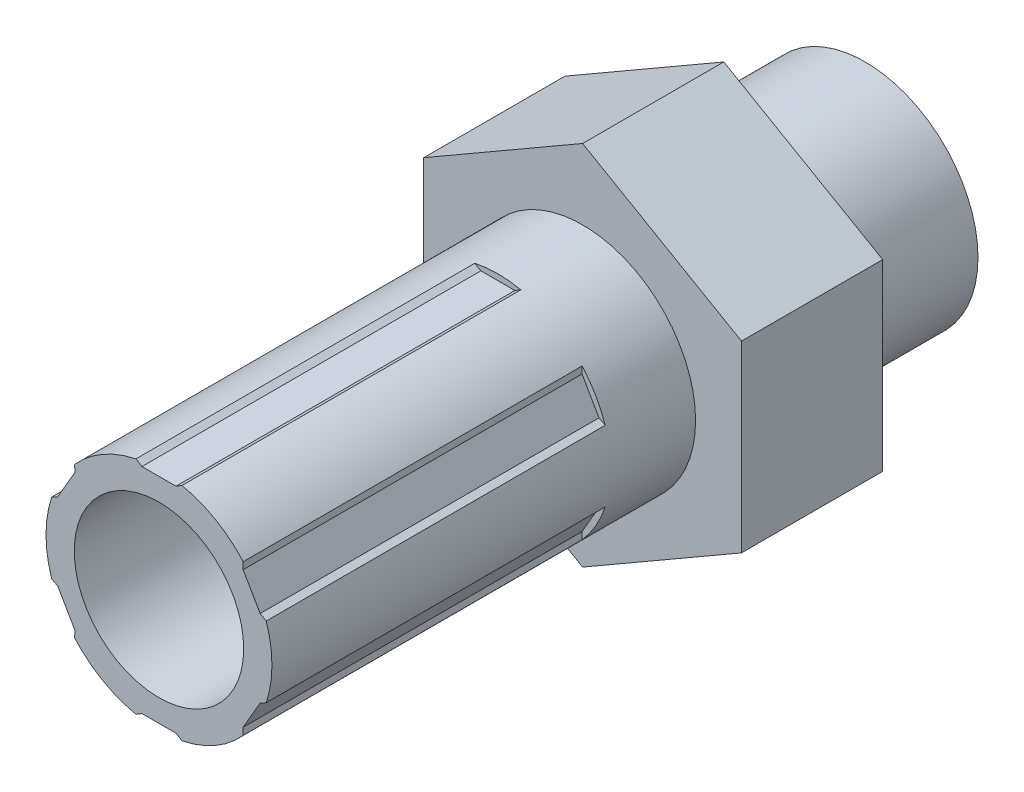
ISO-10303-21;
HEADER;
FILE_DESCRIPTION(('STEP AP214'),'2;1');
FILE_NAME('part.step','',(''),(''),'','','');
FILE_SCHEMA(('AUTOMOTIVE_DESIGN { 1 0 10303 214 1 1 1 1 }'));
ENDSEC;
DATA;
#1=APPLICATION_CONTEXT('core data for automotive mechanical design processes');
#2=APPLICATION_PROTOCOL_DEFINITION('international standard','automotive_design',2000,#1);
#3=PRODUCT_CONTEXT('',#1,'mechanical');
#4=PRODUCT('Part','Part','',(#3));
#5=PRODUCT_RELATED_PRODUCT_CATEGORY('part','',(#4));
#6=PRODUCT_DEFINITION_FORMATION('','',#4);
#7=PRODUCT_DEFINITION_CONTEXT('part definition',#1,'design');
#8=PRODUCT_DEFINITION('design','',#6,#7);
#9=PRODUCT_DEFINITION_SHAPE('','',#8);
#10=(LENGTH_UNIT() NAMED_UNIT(*) SI_UNIT(.MILLI.,.METRE.));
#11=(NAMED_UNIT(*) PLANE_ANGLE_UNIT() SI_UNIT($,.RADIAN.));
#12=(NAMED_UNIT(*) SI_UNIT($,.STERADIAN.) SOLID_ANGLE_UNIT());
#13=UNCERTAINTY_MEASURE_WITH_UNIT(LENGTH_MEASURE(1.E-05),#10,'distance_accuracy_value','');
#14=(GEOMETRIC_REPRESENTATION_CONTEXT(3) GLOBAL_UNCERTAINTY_ASSIGNED_CONTEXT((#13)) GLOBAL_UNIT_ASSIGNED_CONTEXT((#10,
#11,#12)) REPRESENTATION_CONTEXT('',''));
#15=CARTESIAN_POINT('',(0.,0.,0.));
#16=DIRECTION('',(0.,0.,1.));
#17=DIRECTION('',(1.,0.,0.));
#18=AXIS2_PLACEMENT_3D('',#15,#16,#17);
#19=CARTESIAN_POINT('',(0.,8.24889197104678,6.35));
#20=DIRECTION('',(0.,0.,1.));
#21=DIRECTION('',(1.,0.,0.));
#22=AXIS2_PLACEMENT_3D('',#19,#20,#21);
#23=PLANE('',#22);
#24=DIRECTION('',(-0.866025403784439,0.5,0.));
#25=VECTOR('',#24,1.);
#26=CARTESIAN_POINT('',(7.14375,4.12444598552339,6.35));
#27=LINE('',#26,#25);
#28=CARTESIAN_POINT('',(7.14375,4.12444598552339,6.35));
#29=VERTEX_POINT('',#28);
#30=CARTESIAN_POINT('',(0.,8.24889197104678,6.35));
#31=VERTEX_POINT('',#30);
#32=EDGE_CURVE('E388',#29,#31,#27,.T.);
#33=ORIENTED_EDGE('',*,*,#32,.T.);
#34=DIRECTION('',(-0.866025403784438,-0.5,0.));
#35=VECTOR('',#34,1.);
#36=CARTESIAN_POINT('',(0.,8.24889197104678,6.35));
#37=LINE('',#36,#35);
#38=CARTESIAN_POINT('',(-7.14375,4.12444598552338,6.35));
#39=VERTEX_POINT('',#38);
#40=EDGE_CURVE('E391',#31,#39,#37,.T.);
#41=ORIENTED_EDGE('',*,*,#40,.T.);
#42=DIRECTION('',(0.,-1.,0.));
#43=VECTOR('',#42,1.);
#44=CARTESIAN_POINT('',(-7.14375,4.12444598552338,6.35));
#45=LINE('',#44,#43);
#46=CARTESIAN_POINT('',(-7.14375,-4.12444598552339,6.35));
#47=VERTEX_POINT('',#46);
#48=EDGE_CURVE('E394',#39,#47,#45,.T.);
#49=ORIENTED_EDGE('',*,*,#48,.T.);
#50=DIRECTION('',(0.866025403784439,-0.5,0.));
#51=VECTOR('',#50,1.);
#52=CARTESIAN_POINT('',(-7.14375,-4.12444598552339,6.35));
#53=LINE('',#52,#51);
#54=CARTESIAN_POINT('',(0.,-8.24889197104678,6.35));
#55=VERTEX_POINT('',#54);
#56=EDGE_CURVE('E396',#47,#55,#53,.T.);
#57=ORIENTED_EDGE('',*,*,#56,.T.);
#58=DIRECTION('',(0.866025403784439,0.5,0.));
#59=VECTOR('',#58,1.);
#60=CARTESIAN_POINT('',(0.,-8.24889197104678,6.35));
#61=LINE('',#60,#59);
#62=CARTESIAN_POINT('',(7.14375,-4.12444598552339,6.35));
#63=VERTEX_POINT('',#62);
#64=EDGE_CURVE('E398',#55,#63,#61,.T.);
#65=ORIENTED_EDGE('',*,*,#64,.T.);
#66=DIRECTION('',(0.,1.,0.));
#67=VECTOR('',#66,1.);
#68=CARTESIAN_POINT('',(7.14375,-4.12444598552339,6.35));
#69=LINE('',#68,#67);
#70=EDGE_CURVE('E400',#63,#29,#69,.T.);
#71=ORIENTED_EDGE('',*,*,#70,.T.);
#72=EDGE_LOOP('',(#33,#41,#49,#57,#65,#71));
#73=FACE_BOUND('',#72,.T.);
#74=CARTESIAN_POINT('',(0.,0.,6.35));
#75=DIRECTION('',(0.,0.,1.));
#76=DIRECTION('',(1.,0.,0.));
#77=AXIS2_PLACEMENT_3D('',#74,#75,#76);
#78=CIRCLE('',#77,5.08);
#79=CARTESIAN_POINT('',(5.08,0.,6.35));
#80=VERTEX_POINT('',#79);
#81=EDGE_CURVE('E374',#80,#80,#78,.T.);
#82=ORIENTED_EDGE('',*,*,#81,.F.);
#83=EDGE_LOOP('',(#82));
#84=FACE_BOUND('',#83,.T.);
#85=ADVANCED_FACE('F32',(#73,#84),#23,.T.);
#86=CARTESIAN_POINT('',(0.,8.24889197104678,0.));
#87=DIRECTION('',(0.,0.,1.));
#88=DIRECTION('',(1.,0.,0.));
#89=AXIS2_PLACEMENT_3D('',#86,#87,#88);
#90=PLANE('',#89);
#91=DIRECTION('',(-0.866025403784439,0.5,0.));
#92=VECTOR('',#91,1.);
#93=CARTESIAN_POINT('',(7.14375,4.12444598552339,0.));
#94=LINE('',#93,#92);
#95=CARTESIAN_POINT('',(7.14375,4.12444598552339,0.));
#96=VERTEX_POINT('',#95);
#97=CARTESIAN_POINT('',(0.,8.24889197104678,0.));
#98=VERTEX_POINT('',#97);
#99=EDGE_CURVE('E387',#96,#98,#94,.T.);
#100=ORIENTED_EDGE('',*,*,#99,.F.);
#101=DIRECTION('',(0.,1.,0.));
#102=VECTOR('',#101,1.);
#103=CARTESIAN_POINT('',(7.14375,-4.12444598552339,0.));
#104=LINE('',#103,#102);
#105=CARTESIAN_POINT('',(7.14375,-4.12444598552339,0.));
#106=VERTEX_POINT('',#105);
#107=EDGE_CURVE('E392',#106,#96,#104,.T.);
#108=ORIENTED_EDGE('',*,*,#107,.F.);
#109=DIRECTION('',(0.866025403784439,0.5,0.));
#110=VECTOR('',#109,1.);
#111=CARTESIAN_POINT('',(0.,-8.24889197104678,0.));
#112=LINE('',#111,#110);
#113=CARTESIAN_POINT('',(0.,-8.24889197104678,0.));
#114=VERTEX_POINT('',#113);
#115=EDGE_CURVE('E411',#114,#106,#112,.T.);
#116=ORIENTED_EDGE('',*,*,#115,.F.);
#117=DIRECTION('',(0.866025403784439,-0.5,0.));
#118=VECTOR('',#117,1.);
#119=CARTESIAN_POINT('',(-7.14375,-4.12444598552339,0.));
#120=LINE('',#119,#118);
#121=CARTESIAN_POINT('',(-7.14375,-4.12444598552339,0.));
#122=VERTEX_POINT('',#121);
#123=EDGE_CURVE('E409',#122,#114,#120,.T.);
#124=ORIENTED_EDGE('',*,*,#123,.F.);
#125=DIRECTION('',(0.,-1.,0.));
#126=VECTOR('',#125,1.);
#127=CARTESIAN_POINT('',(-7.14375,4.12444598552338,0.));
#128=LINE('',#127,#126);
#129=CARTESIAN_POINT('',(-7.14375,4.12444598552338,0.));
#130=VERTEX_POINT('',#129);
#131=EDGE_CURVE('E407',#130,#122,#128,.T.);
#132=ORIENTED_EDGE('',*,*,#131,.F.);
#133=DIRECTION('',(-0.866025403784438,-0.5,0.));
#134=VECTOR('',#133,1.);
#135=CARTESIAN_POINT('',(0.,8.24889197104678,0.));
#136=LINE('',#135,#134);
#137=EDGE_CURVE('E405',#98,#130,#136,.T.);
#138=ORIENTED_EDGE('',*,*,#137,.F.);
#139=EDGE_LOOP('',(#100,#108,#116,#124,#132,#138));
#140=FACE_BOUND('',#139,.T.);
#141=CARTESIAN_POINT('',(0.,0.,0.));
#142=DIRECTION('',(0.,0.,1.));
#143=DIRECTION('',(1.,0.,0.));
#144=AXIS2_PLACEMENT_3D('',#141,#142,#143);
#145=CIRCLE('',#144,5.08);
#146=CARTESIAN_POINT('',(5.08,0.,0.));
#147=VERTEX_POINT('',#146);
#148=EDGE_CURVE('E431',#147,#147,#145,.F.);
#149=ORIENTED_EDGE('',*,*,#148,.F.);
#150=EDGE_LOOP('',(#149));
#151=FACE_BOUND('',#150,.T.);
#152=ADVANCED_FACE('F538',(#140,#151),#90,.F.);
#153=CARTESIAN_POINT('',(7.14375,4.12444598552339,6.35));
#154=DIRECTION('',(-0.5,-0.866025403784439,0.));
#155=DIRECTION('',(0.866025403784439,-0.5,0.));
#156=AXIS2_PLACEMENT_3D('',#153,#154,#155);
#157=PLANE('',#156);
#158=ORIENTED_EDGE('',*,*,#99,.T.);
#159=DIRECTION('',(0.,0.,-1.));
#160=VECTOR('',#159,1.);
#161=CARTESIAN_POINT('',(0.,8.24889197104678,6.35));
#162=LINE('',#161,#160);
#163=EDGE_CURVE('E428',#31,#98,#162,.T.);
#164=ORIENTED_EDGE('',*,*,#163,.F.);
#165=ORIENTED_EDGE('',*,*,#32,.F.);
#166=DIRECTION('',(0.,0.,-1.));
#167=VECTOR('',#166,1.);
#168=CARTESIAN_POINT('',(7.14375,4.12444598552339,6.35));
#169=LINE('',#168,#167);
#170=EDGE_CURVE('E402',#29,#96,#169,.T.);
#171=ORIENTED_EDGE('',*,*,#170,.T.);
#172=EDGE_LOOP('',(#158,#164,#165,#171));
#173=FACE_BOUND('',#172,.T.);
#174=ADVANCED_FACE('F34',(#173),#157,.F.);
#175=CARTESIAN_POINT('',(0.,8.24889197104678,6.35));
#176=DIRECTION('',(0.5,-0.866025403784438,0.));
#177=DIRECTION('',(0.866025403784438,0.500000000000001,0.));
#178=AXIS2_PLACEMENT_3D('',#175,#176,#177);
#179=PLANE('',#178);
#180=ORIENTED_EDGE('',*,*,#137,.T.);
#181=DIRECTION('',(0.,0.,-1.));
#182=VECTOR('',#181,1.);
#183=CARTESIAN_POINT('',(-7.14375,4.12444598552338,6.35));
#184=LINE('',#183,#182);
#185=EDGE_CURVE('E425',#39,#130,#184,.T.);
#186=ORIENTED_EDGE('',*,*,#185,.F.);
#187=ORIENTED_EDGE('',*,*,#40,.F.);
#188=ORIENTED_EDGE('',*,*,#163,.T.);
#189=EDGE_LOOP('',(#180,#186,#187,#188));
#190=FACE_BOUND('',#189,.T.);
#191=ADVANCED_FACE('F565',(#190),#179,.F.);
#192=CARTESIAN_POINT('',(-7.14375,4.12444598552338,6.35));
#193=DIRECTION('',(1.,0.,0.));
#194=DIRECTION('',(0.,0.,-1.));
#195=AXIS2_PLACEMENT_3D('',#192,#193,#194);
#196=PLANE('',#195);
#197=ORIENTED_EDGE('',*,*,#131,.T.);
#198=DIRECTION('',(0.,0.,-1.));
#199=VECTOR('',#198,1.);
#200=CARTESIAN_POINT('',(-7.14375,-4.12444598552339,6.35));
#201=LINE('',#200,#199);
#202=EDGE_CURVE('E422',#47,#122,#201,.T.);
#203=ORIENTED_EDGE('',*,*,#202,.F.);
#204=ORIENTED_EDGE('',*,*,#48,.F.);
#205=ORIENTED_EDGE('',*,*,#185,.T.);
#206=EDGE_LOOP('',(#197,#203,#204,#205));
#207=FACE_BOUND('',#206,.T.);
#208=ADVANCED_FACE('F562',(#207),#196,.F.);
#209=CARTESIAN_POINT('',(-7.14375,-4.12444598552339,6.35));
#210=DIRECTION('',(0.5,0.866025403784439,0.));
#211=DIRECTION('',(-0.866025403784439,0.5,0.));
#212=AXIS2_PLACEMENT_3D('',#209,#210,#211);
#213=PLANE('',#212);
#214=ORIENTED_EDGE('',*,*,#123,.T.);
#215=DIRECTION('',(0.,0.,-1.));
#216=VECTOR('',#215,1.);
#217=CARTESIAN_POINT('',(0.,-8.24889197104678,6.35));
#218=LINE('',#217,#216);
#219=EDGE_CURVE('E419',#55,#114,#218,.T.);
#220=ORIENTED_EDGE('',*,*,#219,.F.);
#221=ORIENTED_EDGE('',*,*,#56,.F.);
#222=ORIENTED_EDGE('',*,*,#202,.T.);
#223=EDGE_LOOP('',(#214,#220,#221,#222));
#224=FACE_BOUND('',#223,.T.);
#225=ADVANCED_FACE('F558',(#224),#213,.F.);
#226=CARTESIAN_POINT('',(0.,-8.24889197104678,6.35));
#227=DIRECTION('',(-0.5,0.866025403784439,0.));
#228=DIRECTION('',(-0.866025403784439,-0.5,0.));
#229=AXIS2_PLACEMENT_3D('',#226,#227,#228);
#230=PLANE('',#229);
#231=ORIENTED_EDGE('',*,*,#115,.T.);
#232=DIRECTION('',(0.,0.,-1.));
#233=VECTOR('',#232,1.);
#234=CARTESIAN_POINT('',(7.14375,-4.12444598552339,6.35));
#235=LINE('',#234,#233);
#236=EDGE_CURVE('E416',#63,#106,#235,.T.);
#237=ORIENTED_EDGE('',*,*,#236,.F.);
#238=ORIENTED_EDGE('',*,*,#64,.F.);
#239=ORIENTED_EDGE('',*,*,#219,.T.);
#240=EDGE_LOOP('',(#231,#237,#238,#239));
#241=FACE_BOUND('',#240,.T.);
#242=ADVANCED_FACE('F554',(#241),#230,.F.);
#243=CARTESIAN_POINT('',(7.14375,-4.12444598552339,6.35));
#244=DIRECTION('',(-1.,0.,0.));
#245=DIRECTION('',(0.,-1.,0.));
#246=AXIS2_PLACEMENT_3D('',#243,#244,#245);
#247=PLANE('',#246);
#248=ORIENTED_EDGE('',*,*,#107,.T.);
#249=ORIENTED_EDGE('',*,*,#170,.F.);
#250=ORIENTED_EDGE('',*,*,#70,.F.);
#251=ORIENTED_EDGE('',*,*,#236,.T.);
#252=EDGE_LOOP('',(#248,#249,#250,#251));
#253=FACE_BOUND('',#252,.T.);
#254=ADVANCED_FACE('F551',(#253),#247,.F.);
#255=CARTESIAN_POINT('',(0.,0.,-6.35));
#256=DIRECTION('',(0.,0.,1.));
#257=DIRECTION('',(1.,0.,0.));
#258=AXIS2_PLACEMENT_3D('',#255,#256,#257);
#259=CYLINDRICAL_SURFACE('',#258,5.08);
#260=CARTESIAN_POINT('',(0.,0.,-6.35));
#261=DIRECTION('',(0.,0.,-1.));
#262=DIRECTION('',(-1.,0.,0.));
#263=AXIS2_PLACEMENT_3D('',#260,#261,#262);
#264=CIRCLE('',#263,5.08);
#265=CARTESIAN_POINT('',(-5.08,0.,-6.35));
#266=VERTEX_POINT('',#265);
#267=EDGE_CURVE('E380',#266,#266,#264,.T.);
#268=ORIENTED_EDGE('',*,*,#267,.F.);
#269=EDGE_LOOP('',(#268));
#270=FACE_BOUND('',#269,.T.);
#271=ORIENTED_EDGE('',*,*,#148,.T.);
#272=EDGE_LOOP('',(#271));
#273=FACE_BOUND('',#272,.T.);
#274=ADVANCED_FACE('F548',(#270,#273),#259,.T.);
#275=CARTESIAN_POINT('',(0.,0.,-6.35));
#276=DIRECTION('',(0.,0.,-1.));
#277=DIRECTION('',(-1.,0.,0.));
#278=AXIS2_PLACEMENT_3D('',#275,#276,#277);
#279=PLANE('',#278);
#280=CARTESIAN_POINT('',(0.,0.,-6.35));
#281=DIRECTION('',(0.,0.,1.));
#282=DIRECTION('',(1.,0.,0.));
#283=AXIS2_PLACEMENT_3D('',#280,#281,#282);
#284=CIRCLE('',#283,3.81);
#285=CARTESIAN_POINT('',(3.81,0.,-6.35));
#286=VERTEX_POINT('',#285);
#287=EDGE_CURVE('E371',#286,#286,#284,.T.);
#288=ORIENTED_EDGE('',*,*,#287,.T.);
#289=EDGE_LOOP('',(#288));
#290=FACE_BOUND('',#289,.T.);
#291=ORIENTED_EDGE('',*,*,#267,.T.);
#292=EDGE_LOOP('',(#291));
#293=FACE_BOUND('',#292,.T.);
#294=ADVANCED_FACE('F593',(#290,#293),#279,.T.);
#295=CARTESIAN_POINT('',(0.,0.,25.4));
#296=DIRECTION('',(0.,0.,-1.));
#297=DIRECTION('',(-1.,0.,0.));
#298=AXIS2_PLACEMENT_3D('',#295,#296,#297);
#299=CYLINDRICAL_SURFACE('',#298,5.08);
#300=CARTESIAN_POINT('',(0.,0.,25.4));
#301=DIRECTION('',(0.,0.,1.));
#302=DIRECTION('',(1.,0.,0.));
#303=AXIS2_PLACEMENT_3D('',#300,#301,#302);
#304=CIRCLE('',#303,5.08);
#305=CARTESIAN_POINT('',(3.78960210015848,3.38309265650151,25.4));
#306=VERTEX_POINT('',#305);
#307=CARTESIAN_POINT('',(1.03504313380759,4.97343801722287,25.4));
#308=VERTEX_POINT('',#307);
#309=EDGE_CURVE('E382',#306,#308,#304,.T.);
#310=ORIENTED_EDGE('',*,*,#309,.F.);
#311=DIRECTION('',(0.,0.,-1.));
#312=VECTOR('',#311,1.);
#313=CARTESIAN_POINT('',(3.78960210015848,3.38309265650151,25.4));
#314=LINE('',#313,#312);
#315=CARTESIAN_POINT('',(3.78960210015848,3.38309265650151,10.16));
#316=VERTEX_POINT('',#315);
#317=EDGE_CURVE('E258',#306,#316,#314,.T.);
#318=ORIENTED_EDGE('',*,*,#317,.T.);
#319=CARTESIAN_POINT('',(0.,0.,10.16));
#320=DIRECTION('',(0.,0.,-1.));
#321=DIRECTION('',(-1.,0.,0.));
#322=AXIS2_PLACEMENT_3D('',#319,#320,#321);
#323=CIRCLE('',#322,5.08);
#324=CARTESIAN_POINT('',(4.82464523396609,1.59034536072146,10.16));
#325=VERTEX_POINT('',#324);
#326=EDGE_CURVE('E11',#316,#325,#323,.T.);
#327=ORIENTED_EDGE('',*,*,#326,.T.);
#328=DIRECTION('',(0.,0.,-1.));
#329=VECTOR('',#328,1.);
#330=CARTESIAN_POINT('',(4.82464523396609,1.59034536072146,25.4));
#331=LINE('',#330,#329);
#332=CARTESIAN_POINT('',(4.82464523396609,1.59034536072146,25.4));
#333=VERTEX_POINT('',#332);
#334=EDGE_CURVE('E250',#325,#333,#331,.F.);
#335=ORIENTED_EDGE('',*,*,#334,.T.);
#336=CARTESIAN_POINT('',(4.82464523396613,-1.59034536072136,25.4));
#337=VERTEX_POINT('',#336);
#338=EDGE_CURVE('E472',#337,#333,#304,.T.);
#339=ORIENTED_EDGE('',*,*,#338,.F.);
#340=DIRECTION('',(0.,0.,-1.));
#341=VECTOR('',#340,1.);
#342=CARTESIAN_POINT('',(4.82464523396613,-1.59034536072136,25.4));
#343=LINE('',#342,#341);
#344=CARTESIAN_POINT('',(4.82464523396613,-1.59034536072136,10.16));
#345=VERTEX_POINT('',#344);
#346=EDGE_CURVE('E278',#337,#345,#343,.T.);
#347=ORIENTED_EDGE('',*,*,#346,.T.);
#348=CARTESIAN_POINT('',(0.,0.,10.16));
#349=DIRECTION('',(0.,0.,-1.));
#350=DIRECTION('',(-1.,0.,0.));
#351=AXIS2_PLACEMENT_3D('',#348,#349,#350);
#352=CIRCLE('',#351,5.08);
#353=CARTESIAN_POINT('',(3.78960210015855,-3.38309265650143,10.16));
#354=VERTEX_POINT('',#353);
#355=EDGE_CURVE('E460',#345,#354,#352,.T.);
#356=ORIENTED_EDGE('',*,*,#355,.T.);
#357=DIRECTION('',(0.,0.,-1.));
#358=VECTOR('',#357,1.);
#359=CARTESIAN_POINT('',(3.78960210015855,-3.38309265650143,25.4));
#360=LINE('',#359,#358);
#361=CARTESIAN_POINT('',(3.78960210015855,-3.38309265650143,25.4));
#362=VERTEX_POINT('',#361);
#363=EDGE_CURVE('E274',#354,#362,#360,.F.);
#364=ORIENTED_EDGE('',*,*,#363,.T.);
#365=CARTESIAN_POINT('',(1.0350431338076,-4.97343801722287,25.4));
#366=VERTEX_POINT('',#365);
#367=EDGE_CURVE('E477',#366,#362,#304,.T.);
#368=ORIENTED_EDGE('',*,*,#367,.F.);
#369=DIRECTION('',(0.,0.,-1.));
#370=VECTOR('',#369,1.);
#371=CARTESIAN_POINT('',(1.0350431338076,-4.97343801722287,25.4));
#372=LINE('',#371,#370);
#373=CARTESIAN_POINT('',(1.0350431338076,-4.97343801722287,10.16));
#374=VERTEX_POINT('',#373);
#375=EDGE_CURVE('E300',#366,#374,#372,.T.);
#376=ORIENTED_EDGE('',*,*,#375,.T.);
#377=CARTESIAN_POINT('',(0.,0.,10.16));
#378=DIRECTION('',(0.,0.,-1.));
#379=DIRECTION('',(-1.,0.,0.));
#380=AXIS2_PLACEMENT_3D('',#377,#378,#379);
#381=CIRCLE('',#380,5.08);
#382=CARTESIAN_POINT('',(-1.03504313380759,-4.97343801722287,10.16));
#383=VERTEX_POINT('',#382);
#384=EDGE_CURVE('E455',#374,#383,#381,.T.);
#385=ORIENTED_EDGE('',*,*,#384,.T.);
#386=DIRECTION('',(0.,0.,-1.));
#387=VECTOR('',#386,1.);
#388=CARTESIAN_POINT('',(-1.03504313380759,-4.97343801722287,25.4));
#389=LINE('',#388,#387);
#390=CARTESIAN_POINT('',(-1.03504313380759,-4.97343801722287,25.4));
#391=VERTEX_POINT('',#390);
#392=EDGE_CURVE('E296',#383,#391,#389,.F.);
#393=ORIENTED_EDGE('',*,*,#392,.T.);
#394=CARTESIAN_POINT('',(-3.7896021001585,-3.38309265650149,25.4));
#395=VERTEX_POINT('',#394);
#396=EDGE_CURVE('E479',#395,#391,#304,.T.);
#397=ORIENTED_EDGE('',*,*,#396,.F.);
#398=DIRECTION('',(0.,0.,-1.));
#399=VECTOR('',#398,1.);
#400=CARTESIAN_POINT('',(-3.7896021001585,-3.38309265650148,25.4));
#401=LINE('',#400,#399);
#402=CARTESIAN_POINT('',(-3.7896021001585,-3.38309265650149,10.16));
#403=VERTEX_POINT('',#402);
#404=EDGE_CURVE('E322',#395,#403,#401,.T.);
#405=ORIENTED_EDGE('',*,*,#404,.T.);
#406=CARTESIAN_POINT('',(0.,0.,10.16));
#407=DIRECTION('',(0.,0.,-1.));
#408=DIRECTION('',(-1.,0.,0.));
#409=AXIS2_PLACEMENT_3D('',#406,#407,#408);
#410=CIRCLE('',#409,5.08);
#411=CARTESIAN_POINT('',(-4.8246452339661,-1.59034536072143,10.16));
#412=VERTEX_POINT('',#411);
#413=EDGE_CURVE('E449',#403,#412,#410,.T.);
#414=ORIENTED_EDGE('',*,*,#413,.T.);
#415=DIRECTION('',(0.,0.,-1.));
#416=VECTOR('',#415,1.);
#417=CARTESIAN_POINT('',(-4.8246452339661,-1.59034536072143,25.4));
#418=LINE('',#417,#416);
#419=CARTESIAN_POINT('',(-4.8246452339661,-1.59034536072143,25.4));
#420=VERTEX_POINT('',#419);
#421=EDGE_CURVE('E318',#412,#420,#418,.F.);
#422=ORIENTED_EDGE('',*,*,#421,.T.);
#423=CARTESIAN_POINT('',(-4.82464523396612,1.59034536072139,25.4));
#424=VERTEX_POINT('',#423);
#425=EDGE_CURVE('E381',#424,#420,#304,.T.);
#426=ORIENTED_EDGE('',*,*,#425,.F.);
#427=DIRECTION('',(0.,0.,-1.));
#428=VECTOR('',#427,1.);
#429=CARTESIAN_POINT('',(-4.82464523396612,1.59034536072139,25.4));
#430=LINE('',#429,#428);
#431=CARTESIAN_POINT('',(-4.82464523396612,1.59034536072139,10.16));
#432=VERTEX_POINT('',#431);
#433=EDGE_CURVE('E344',#424,#432,#430,.T.);
#434=ORIENTED_EDGE('',*,*,#433,.T.);
#435=CARTESIAN_POINT('',(0.,0.,10.16));
#436=DIRECTION('',(0.,0.,-1.));
#437=DIRECTION('',(-1.,0.,0.));
#438=AXIS2_PLACEMENT_3D('',#435,#436,#437);
#439=CIRCLE('',#438,5.08);
#440=CARTESIAN_POINT('',(-3.78960210015852,3.38309265650146,10.16));
#441=VERTEX_POINT('',#440);
#442=EDGE_CURVE('E443',#432,#441,#439,.T.);
#443=ORIENTED_EDGE('',*,*,#442,.T.);
#444=DIRECTION('',(0.,0.,-1.));
#445=VECTOR('',#444,1.);
#446=CARTESIAN_POINT('',(-3.78960210015852,3.38309265650146,25.4));
#447=LINE('',#446,#445);
#448=CARTESIAN_POINT('',(-3.78960210015852,3.38309265650146,25.4));
#449=VERTEX_POINT('',#448);
#450=EDGE_CURVE('E340',#441,#449,#447,.F.);
#451=ORIENTED_EDGE('',*,*,#450,.T.);
#452=CARTESIAN_POINT('',(-1.0350431338076,4.97343801722287,25.4));
#453=VERTEX_POINT('',#452);
#454=EDGE_CURVE('E377',#453,#449,#304,.T.);
#455=ORIENTED_EDGE('',*,*,#454,.F.);
#456=DIRECTION('',(0.,0.,-1.));
#457=VECTOR('',#456,1.);
#458=CARTESIAN_POINT('',(-1.0350431338076,4.97343801722287,25.4));
#459=LINE('',#458,#457);
#460=CARTESIAN_POINT('',(-1.0350431338076,4.97343801722287,10.16));
#461=VERTEX_POINT('',#460);
#462=EDGE_CURVE('E367',#453,#461,#459,.T.);
#463=ORIENTED_EDGE('',*,*,#462,.T.);
#464=CARTESIAN_POINT('',(0.,0.,10.16));
#465=DIRECTION('',(0.,0.,-1.));
#466=DIRECTION('',(-1.,0.,0.));
#467=AXIS2_PLACEMENT_3D('',#464,#465,#466);
#468=CIRCLE('',#467,5.08);
#469=CARTESIAN_POINT('',(1.03504313380759,4.97343801722287,10.16));
#470=VERTEX_POINT('',#469);
#471=EDGE_CURVE('E437',#461,#470,#468,.T.);
#472=ORIENTED_EDGE('',*,*,#471,.T.);
#473=DIRECTION('',(0.,0.,-1.));
#474=VECTOR('',#473,1.);
#475=CARTESIAN_POINT('',(1.03504313380759,4.97343801722287,25.4));
#476=LINE('',#475,#474);
#477=EDGE_CURVE('E363',#470,#308,#476,.F.);
#478=ORIENTED_EDGE('',*,*,#477,.T.);
#479=EDGE_LOOP('',(#310,#318,#327,#335,#339,#347,#356,#364,#368,#376,#385,#393,#397,#405,#414,
#422,#426,#434,#443,#451,#455,#463,#472,#478));
#480=FACE_BOUND('',#479,.T.);
#481=ORIENTED_EDGE('',*,*,#81,.T.);
#482=EDGE_LOOP('',(#481));
#483=FACE_BOUND('',#482,.T.);
#484=ADVANCED_FACE('F474',(#480,#483),#299,.T.);
#485=CARTESIAN_POINT('',(0.,0.,25.4));
#486=DIRECTION('',(0.,0.,1.));
#487=DIRECTION('',(1.,0.,0.));
#488=AXIS2_PLACEMENT_3D('',#485,#486,#487);
#489=PLANE('',#488);
#490=DIRECTION('',(-0.0182480021958293,-0.999833491345364,0.));
#491=VECTOR('',#490,1.);
#492=CARTESIAN_POINT('',(3.72661579926544,-0.0680146183105983,25.4));
#493=LINE('',#492,#491);
#494=CARTESIAN_POINT('',(3.78385145208478,3.06800662794245,25.4));
#495=VERTEX_POINT('',#494);
#496=EDGE_CURVE('E40',#306,#495,#493,.T.);
#497=ORIENTED_EDGE('',*,*,#496,.F.);
#498=ORIENTED_EDGE('',*,*,#309,.T.);
#499=DIRECTION('',(0.856757201961654,0.515719979142595,0.));
#500=VECTOR('',#499,1.);
#501=CARTESIAN_POINT('',(0.765045952734751,4.81091479562329,25.4));
#502=LINE('',#501,#500);
#503=CARTESIAN_POINT('',(0.765045952734751,4.81091479562329,25.4));
#504=VERTEX_POINT('',#503);
#505=EDGE_CURVE('E351',#504,#308,#502,.T.);
#506=ORIENTED_EDGE('',*,*,#505,.F.);
#507=DIRECTION('',(1.,0.,0.));
#508=VECTOR('',#507,1.);
#509=CARTESIAN_POINT('',(0.,4.81091479562329,25.4));
#510=LINE('',#509,#508);
#511=CARTESIAN_POINT('',(-0.765045952734751,4.81091479562329,25.4));
#512=VERTEX_POINT('',#511);
#513=EDGE_CURVE('E347',#512,#504,#510,.T.);
#514=ORIENTED_EDGE('',*,*,#513,.F.);
#515=DIRECTION('',(0.856757201961654,-0.515719979142595,0.));
#516=VECTOR('',#515,1.);
#517=CARTESIAN_POINT('',(1.92221028691844,3.193336643153,25.4));
#518=LINE('',#517,#516);
#519=EDGE_CURVE('E434',#453,#512,#518,.T.);
#520=ORIENTED_EDGE('',*,*,#519,.F.);
#521=ORIENTED_EDGE('',*,*,#454,.T.);
#522=DIRECTION('',(-0.0182480021958435,0.999833491345364,0.));
#523=VECTOR('',#522,1.);
#524=CARTESIAN_POINT('',(-3.78385145208483,3.0680066279424,25.4));
#525=LINE('',#524,#523);
#526=CARTESIAN_POINT('',(-3.78385145208483,3.0680066279424,25.4));
#527=VERTEX_POINT('',#526);
#528=EDGE_CURVE('E329',#527,#449,#525,.T.);
#529=ORIENTED_EDGE('',*,*,#528,.F.);
#530=DIRECTION('',(0.499999999999998,0.86602540378444,0.));
#531=VECTOR('',#530,1.);
#532=CARTESIAN_POINT('',(-4.1663744284522,2.40545739781164,25.4));
#533=LINE('',#532,#531);
#534=CARTESIAN_POINT('',(-4.54889740481957,1.74290816768087,25.4));
#535=VERTEX_POINT('',#534);
#536=EDGE_CURVE('E325',#535,#527,#533,.T.);
#537=ORIENTED_EDGE('',*,*,#536,.F.);
#538=DIRECTION('',(0.875005204157493,0.484113512202772,0.));
#539=VECTOR('',#538,1.);
#540=CARTESIAN_POINT('',(-1.80440551234701,3.26135126146364,25.4));
#541=LINE('',#540,#539);
#542=EDGE_CURVE('E440',#424,#535,#541,.T.);
#543=ORIENTED_EDGE('',*,*,#542,.F.);
#544=ORIENTED_EDGE('',*,*,#425,.T.);
#545=DIRECTION('',(-0.875005204157497,0.484113512202765,0.));
#546=VECTOR('',#545,1.);
#547=CARTESIAN_POINT('',(-4.54889740481956,-1.74290816768091,25.4));
#548=LINE('',#547,#546);
#549=CARTESIAN_POINT('',(-4.54889740481956,-1.74290816768091,25.4));
#550=VERTEX_POINT('',#549);
#551=EDGE_CURVE('E307',#550,#420,#548,.T.);
#552=ORIENTED_EDGE('',*,*,#551,.F.);
#553=DIRECTION('',(-0.500000000000004,0.866025403784436,0.));
#554=VECTOR('',#553,1.);
#555=CARTESIAN_POINT('',(-4.16637442845218,-2.40545739781167,25.4));
#556=LINE('',#555,#554);
#557=CARTESIAN_POINT('',(-3.78385145208481,-3.06800662794243,25.4));
#558=VERTEX_POINT('',#557);
#559=EDGE_CURVE('E303',#558,#550,#556,.T.);
#560=ORIENTED_EDGE('',*,*,#559,.F.);
#561=DIRECTION('',(0.0182480021958363,0.999833491345364,0.));
#562=VECTOR('',#561,1.);
#563=CARTESIAN_POINT('',(-3.72661579926544,0.0680146183106246,25.4));
#564=LINE('',#563,#562);
#565=EDGE_CURVE('E446',#395,#558,#564,.T.);
#566=ORIENTED_EDGE('',*,*,#565,.F.);
#567=ORIENTED_EDGE('',*,*,#396,.T.);
#568=DIRECTION('',(-0.856757201961654,-0.515719979142595,0.));
#569=VECTOR('',#568,1.);
#570=CARTESIAN_POINT('',(-0.765045952734751,-4.81091479562329,25.4));
#571=LINE('',#570,#569);
#572=CARTESIAN_POINT('',(-0.765045952734751,-4.81091479562329,25.4));
#573=VERTEX_POINT('',#572);
#574=EDGE_CURVE('E285',#573,#391,#571,.T.);
#575=ORIENTED_EDGE('',*,*,#574,.F.);
#576=DIRECTION('',(-1.,0.,0.));
#577=VECTOR('',#576,1.);
#578=CARTESIAN_POINT('',(0.,-4.81091479562329,25.4));
#579=LINE('',#578,#577);
#580=CARTESIAN_POINT('',(0.765045952734751,-4.81091479562329,25.4));
#581=VERTEX_POINT('',#580);
#582=EDGE_CURVE('E281',#581,#573,#579,.T.);
#583=ORIENTED_EDGE('',*,*,#582,.F.);
#584=DIRECTION('',(-0.856757201961654,0.515719979142595,0.));
#585=VECTOR('',#584,1.);
#586=CARTESIAN_POINT('',(-1.92221028691844,-3.193336643153,25.4));
#587=LINE('',#586,#585);
#588=EDGE_CURVE('E452',#366,#581,#587,.T.);
#589=ORIENTED_EDGE('',*,*,#588,.F.);
#590=ORIENTED_EDGE('',*,*,#367,.T.);
#591=DIRECTION('',(0.0182480021958505,-0.999833491345364,0.));
#592=VECTOR('',#591,1.);
#593=CARTESIAN_POINT('',(3.78385145208485,-3.06800662794238,25.4));
#594=LINE('',#593,#592);
#595=CARTESIAN_POINT('',(3.78385145208485,-3.06800662794238,25.4));
#596=VERTEX_POINT('',#595);
#597=EDGE_CURVE('E265',#596,#362,#594,.T.);
#598=ORIENTED_EDGE('',*,*,#597,.F.);
#599=DIRECTION('',(-0.499999999999992,-0.866025403784443,0.));
#600=VECTOR('',#599,1.);
#601=CARTESIAN_POINT('',(4.16637442845222,-2.40545739781161,25.4));
#602=LINE('',#601,#600);
#603=CARTESIAN_POINT('',(4.54889740481959,-1.74290816768084,25.4));
#604=VERTEX_POINT('',#603);
#605=EDGE_CURVE('E261',#604,#596,#602,.T.);
#606=ORIENTED_EDGE('',*,*,#605,.F.);
#607=DIRECTION('',(-0.87500520415749,-0.484113512202778,0.));
#608=VECTOR('',#607,1.);
#609=CARTESIAN_POINT('',(1.80440551234703,-3.26135126146363,25.4));
#610=LINE('',#609,#608);
#611=EDGE_CURVE('E458',#337,#604,#610,.T.);
#612=ORIENTED_EDGE('',*,*,#611,.F.);
#613=ORIENTED_EDGE('',*,*,#338,.T.);
#614=DIRECTION('',(0.8750052041575,-0.484113512202759,0.));
#615=VECTOR('',#614,1.);
#616=CARTESIAN_POINT('',(4.54889740481955,1.74290816768094,25.4));
#617=LINE('',#616,#615);
#618=CARTESIAN_POINT('',(4.54889740481955,1.74290816768094,25.4));
#619=VERTEX_POINT('',#618);
#620=EDGE_CURVE('E239',#619,#333,#617,.T.);
#621=ORIENTED_EDGE('',*,*,#620,.F.);
#622=DIRECTION('',(0.50000000000001,-0.866025403784433,0.));
#623=VECTOR('',#622,1.);
#624=CARTESIAN_POINT('',(4.16637442845217,2.4054573978117,25.4));
#625=LINE('',#624,#623);
#626=EDGE_CURVE('E244',#495,#619,#625,.T.);
#627=ORIENTED_EDGE('',*,*,#626,.F.);
#628=EDGE_LOOP('',(#497,#498,#506,#514,#520,#521,#529,#537,#543,#544,#552,#560,#566,#567,#575,
#583,#589,#590,#598,#606,#612,#613,#621,#627));
#629=FACE_BOUND('',#628,.T.);
#630=CARTESIAN_POINT('',(0.,0.,25.4));
#631=DIRECTION('',(0.,0.,1.));
#632=DIRECTION('',(1.,0.,0.));
#633=AXIS2_PLACEMENT_3D('',#630,#631,#632);
#634=CIRCLE('',#633,3.81);
#635=CARTESIAN_POINT('',(3.81,0.,25.4));
#636=VERTEX_POINT('',#635);
#637=EDGE_CURVE('E370',#636,#636,#634,.T.);
#638=ORIENTED_EDGE('',*,*,#637,.F.);
#639=EDGE_LOOP('',(#638));
#640=FACE_BOUND('',#639,.T.);
#641=ADVANCED_FACE('F467',(#629,#640),#489,.T.);
#642=CARTESIAN_POINT('',(0.,0.,-6.35));
#643=DIRECTION('',(0.,0.,1.));
#644=DIRECTION('',(1.,0.,0.));
#645=AXIS2_PLACEMENT_3D('',#642,#643,#644);
#646=CYLINDRICAL_SURFACE('',#645,3.81);
#647=ORIENTED_EDGE('',*,*,#287,.F.);
#648=EDGE_LOOP('',(#647));
#649=FACE_BOUND('',#648,.T.);
#650=ORIENTED_EDGE('',*,*,#637,.T.);
#651=EDGE_LOOP('',(#650));
#652=FACE_BOUND('',#651,.T.);
#653=ADVANCED_FACE('F608',(#649,#652),#646,.F.);
#654=CARTESIAN_POINT('',(-0.765045952734751,4.81091479562329,10.16));
#655=DIRECTION('',(0.,0.,-1.));
#656=DIRECTION('',(-1.,0.,0.));
#657=AXIS2_PLACEMENT_3D('',#654,#655,#656);
#658=PLANE('',#657);
#659=DIRECTION('',(0.856757201961654,-0.515719979142595,0.));
#660=VECTOR('',#659,1.);
#661=CARTESIAN_POINT('',(-0.765045952734751,4.81091479562329,10.16));
#662=LINE('',#661,#660);
#663=CARTESIAN_POINT('',(-0.765045952734751,4.81091479562329,10.16));
#664=VERTEX_POINT('',#663);
#665=EDGE_CURVE('E354',#461,#664,#662,.T.);
#666=ORIENTED_EDGE('',*,*,#665,.T.);
#667=DIRECTION('',(1.,0.,0.));
#668=VECTOR('',#667,1.);
#669=CARTESIAN_POINT('',(0.,4.81091479562329,10.16));
#670=LINE('',#669,#668);
#671=CARTESIAN_POINT('',(0.765045952734751,4.81091479562329,10.16));
#672=VERTEX_POINT('',#671);
#673=EDGE_CURVE('E348',#664,#672,#670,.T.);
#674=ORIENTED_EDGE('',*,*,#673,.T.);
#675=DIRECTION('',(0.856757201961654,0.515719979142595,0.));
#676=VECTOR('',#675,1.);
#677=CARTESIAN_POINT('',(0.765045952734751,4.81091479562329,10.16));
#678=LINE('',#677,#676);
#679=EDGE_CURVE('E350',#672,#470,#678,.T.);
#680=ORIENTED_EDGE('',*,*,#679,.T.);
#681=ORIENTED_EDGE('',*,*,#471,.F.);
#682=EDGE_LOOP('',(#666,#674,#680,#681));
#683=FACE_BOUND('',#682,.T.);
#684=ADVANCED_FACE('F611',(#683),#658,.F.);
#685=CARTESIAN_POINT('',(-0.765045952734751,4.81091479562329,10.16));
#686=DIRECTION('',(-0.515719979142595,-0.856757201961654,0.));
#687=DIRECTION('',(0.856757201961654,-0.515719979142595,0.));
#688=AXIS2_PLACEMENT_3D('',#685,#686,#687);
#689=PLANE('',#688);
#690=ORIENTED_EDGE('',*,*,#519,.T.);
#691=DIRECTION('',(0.,0.,1.));
#692=VECTOR('',#691,1.);
#693=CARTESIAN_POINT('',(-0.765045952734751,4.81091479562329,10.16));
#694=LINE('',#693,#692);
#695=EDGE_CURVE('E361',#664,#512,#694,.T.);
#696=ORIENTED_EDGE('',*,*,#695,.F.);
#697=ORIENTED_EDGE('',*,*,#665,.F.);
#698=ORIENTED_EDGE('',*,*,#462,.F.);
#699=EDGE_LOOP('',(#690,#696,#697,#698));
#700=FACE_BOUND('',#699,.T.);
#701=ADVANCED_FACE('F621',(#700),#689,.F.);
#702=CARTESIAN_POINT('',(0.765045952734751,4.81091479562329,10.16));
#703=DIRECTION('',(0.515719979142595,-0.856757201961654,0.));
#704=DIRECTION('',(0.856757201961654,0.515719979142595,0.));
#705=AXIS2_PLACEMENT_3D('',#702,#703,#704);
#706=PLANE('',#705);
#707=ORIENTED_EDGE('',*,*,#679,.F.);
#708=DIRECTION('',(0.,0.,1.));
#709=VECTOR('',#708,1.);
#710=CARTESIAN_POINT('',(0.765045952734751,4.81091479562329,10.16));
#711=LINE('',#710,#709);
#712=EDGE_CURVE('E356',#672,#504,#711,.T.);
#713=ORIENTED_EDGE('',*,*,#712,.T.);
#714=ORIENTED_EDGE('',*,*,#505,.T.);
#715=ORIENTED_EDGE('',*,*,#477,.F.);
#716=EDGE_LOOP('',(#707,#713,#714,#715));
#717=FACE_BOUND('',#716,.T.);
#718=ADVANCED_FACE('F617',(#717),#706,.F.);
#719=CARTESIAN_POINT('',(0.,4.81091479562329,10.16));
#720=DIRECTION('',(0.,-1.,0.));
#721=DIRECTION('',(0.,0.,-1.));
#722=AXIS2_PLACEMENT_3D('',#719,#720,#721);
#723=PLANE('',#722);
#724=ORIENTED_EDGE('',*,*,#513,.T.);
#725=ORIENTED_EDGE('',*,*,#712,.F.);
#726=ORIENTED_EDGE('',*,*,#673,.F.);
#727=ORIENTED_EDGE('',*,*,#695,.T.);
#728=EDGE_LOOP('',(#724,#725,#726,#727));
#729=FACE_BOUND('',#728,.T.);
#730=ADVANCED_FACE('F613',(#729),#723,.F.);
#731=CARTESIAN_POINT('',(-4.54889740481957,1.74290816768087,10.16));
#732=DIRECTION('',(0.,0.,-1.));
#733=DIRECTION('',(-0.499999999999998,-0.86602540378444,0.));
#734=AXIS2_PLACEMENT_3D('',#731,#732,#733);
#735=PLANE('',#734);
#736=DIRECTION('',(0.875005204157493,0.484113512202772,0.));
#737=VECTOR('',#736,1.);
#738=CARTESIAN_POINT('',(-4.54889740481957,1.74290816768087,10.16));
#739=LINE('',#738,#737);
#740=CARTESIAN_POINT('',(-4.54889740481957,1.74290816768087,10.16));
#741=VERTEX_POINT('',#740);
#742=EDGE_CURVE('E332',#432,#741,#739,.T.);
#743=ORIENTED_EDGE('',*,*,#742,.T.);
#744=DIRECTION('',(0.499999999999997,0.86602540378444,0.));
#745=VECTOR('',#744,1.);
#746=CARTESIAN_POINT('',(-4.1663744284522,2.40545739781164,10.16));
#747=LINE('',#746,#745);
#748=CARTESIAN_POINT('',(-3.78385145208483,3.0680066279424,10.16));
#749=VERTEX_POINT('',#748);
#750=EDGE_CURVE('E326',#741,#749,#747,.T.);
#751=ORIENTED_EDGE('',*,*,#750,.T.);
#752=DIRECTION('',(-0.0182480021958435,0.999833491345364,0.));
#753=VECTOR('',#752,1.);
#754=CARTESIAN_POINT('',(-3.78385145208483,3.0680066279424,10.16));
#755=LINE('',#754,#753);
#756=EDGE_CURVE('E328',#749,#441,#755,.T.);
#757=ORIENTED_EDGE('',*,*,#756,.T.);
#758=ORIENTED_EDGE('',*,*,#442,.F.);
#759=EDGE_LOOP('',(#743,#751,#757,#758));
#760=FACE_BOUND('',#759,.T.);
#761=ADVANCED_FACE('F616',(#760),#735,.F.);
#762=CARTESIAN_POINT('',(-4.54889740481957,1.74290816768087,10.16));
#763=DIRECTION('',(0.484113512202772,-0.875005204157493,0.));
#764=DIRECTION('',(0.875005204157493,0.484113512202772,0.));
#765=AXIS2_PLACEMENT_3D('',#762,#763,#764);
#766=PLANE('',#765);
#767=ORIENTED_EDGE('',*,*,#542,.T.);
#768=DIRECTION('',(0.,0.,1.));
#769=VECTOR('',#768,1.);
#770=CARTESIAN_POINT('',(-4.54889740481957,1.74290816768087,10.16));
#771=LINE('',#770,#769);
#772=EDGE_CURVE('E338',#741,#535,#771,.T.);
#773=ORIENTED_EDGE('',*,*,#772,.F.);
#774=ORIENTED_EDGE('',*,*,#742,.F.);
#775=ORIENTED_EDGE('',*,*,#433,.F.);
#776=EDGE_LOOP('',(#767,#773,#774,#775));
#777=FACE_BOUND('',#776,.T.);
#778=ADVANCED_FACE('F636',(#777),#766,.F.);
#779=CARTESIAN_POINT('',(-3.78385145208483,3.0680066279424,10.16));
#780=DIRECTION('',(0.999833491345364,0.0182480021958435,0.));
#781=DIRECTION('',(-0.0182480021958435,0.999833491345364,0.));
#782=AXIS2_PLACEMENT_3D('',#779,#780,#781);
#783=PLANE('',#782);
#784=ORIENTED_EDGE('',*,*,#756,.F.);
#785=DIRECTION('',(0.,0.,1.));
#786=VECTOR('',#785,1.);
#787=CARTESIAN_POINT('',(-3.78385145208483,3.0680066279424,10.16));
#788=LINE('',#787,#786);
#789=EDGE_CURVE('E334',#749,#527,#788,.T.);
#790=ORIENTED_EDGE('',*,*,#789,.T.);
#791=ORIENTED_EDGE('',*,*,#528,.T.);
#792=ORIENTED_EDGE('',*,*,#450,.F.);
#793=EDGE_LOOP('',(#784,#790,#791,#792));
#794=FACE_BOUND('',#793,.T.);
#795=ADVANCED_FACE('F632',(#794),#783,.F.);
#796=CARTESIAN_POINT('',(-4.1663744284522,2.40545739781164,10.16));
#797=DIRECTION('',(0.86602540378444,-0.499999999999998,0.));
#798=DIRECTION('',(0.499999999999998,0.86602540378444,0.));
#799=AXIS2_PLACEMENT_3D('',#796,#797,#798);
#800=PLANE('',#799);
#801=ORIENTED_EDGE('',*,*,#536,.T.);
#802=ORIENTED_EDGE('',*,*,#789,.F.);
#803=ORIENTED_EDGE('',*,*,#750,.F.);
#804=ORIENTED_EDGE('',*,*,#772,.T.);
#805=EDGE_LOOP('',(#801,#802,#803,#804));
#806=FACE_BOUND('',#805,.T.);
#807=ADVANCED_FACE('F629',(#806),#800,.F.);
#808=CARTESIAN_POINT('',(-3.7838514520848,-3.06800662794243,10.16));
#809=DIRECTION('',(0.,0.,-1.));
#810=DIRECTION('',(0.500000000000004,-0.866025403784436,0.));
#811=AXIS2_PLACEMENT_3D('',#808,#809,#810);
#812=PLANE('',#811);
#813=DIRECTION('',(0.0182480021958363,0.999833491345364,0.));
#814=VECTOR('',#813,1.);
#815=CARTESIAN_POINT('',(-3.7838514520848,-3.06800662794243,10.16));
#816=LINE('',#815,#814);
#817=CARTESIAN_POINT('',(-3.7838514520848,-3.06800662794243,10.16));
#818=VERTEX_POINT('',#817);
#819=EDGE_CURVE('E310',#403,#818,#816,.T.);
#820=ORIENTED_EDGE('',*,*,#819,.T.);
#821=DIRECTION('',(-0.500000000000005,0.866025403784436,0.));
#822=VECTOR('',#821,1.);
#823=CARTESIAN_POINT('',(-4.16637442845218,-2.40545739781167,10.16));
#824=LINE('',#823,#822);
#825=CARTESIAN_POINT('',(-4.54889740481956,-1.74290816768091,10.16));
#826=VERTEX_POINT('',#825);
#827=EDGE_CURVE('E304',#818,#826,#824,.T.);
#828=ORIENTED_EDGE('',*,*,#827,.T.);
#829=DIRECTION('',(-0.875005204157497,0.484113512202765,0.));
#830=VECTOR('',#829,1.);
#831=CARTESIAN_POINT('',(-4.54889740481956,-1.74290816768091,10.16));
#832=LINE('',#831,#830);
#833=EDGE_CURVE('E306',#826,#412,#832,.T.);
#834=ORIENTED_EDGE('',*,*,#833,.T.);
#835=ORIENTED_EDGE('',*,*,#413,.F.);
#836=EDGE_LOOP('',(#820,#828,#834,#835));
#837=FACE_BOUND('',#836,.T.);
#838=ADVANCED_FACE('F497',(#837),#812,.F.);
#839=CARTESIAN_POINT('',(-3.7838514520848,-3.06800662794243,10.16));
#840=DIRECTION('',(0.999833491345364,-0.0182480021958363,0.));
#841=DIRECTION('',(0.0182480021958363,0.999833491345364,0.));
#842=AXIS2_PLACEMENT_3D('',#839,#840,#841);
#843=PLANE('',#842);
#844=ORIENTED_EDGE('',*,*,#565,.T.);
#845=DIRECTION('',(0.,0.,1.));
#846=VECTOR('',#845,1.);
#847=CARTESIAN_POINT('',(-3.7838514520848,-3.06800662794243,10.16));
#848=LINE('',#847,#846);
#849=EDGE_CURVE('E316',#818,#558,#848,.T.);
#850=ORIENTED_EDGE('',*,*,#849,.F.);
#851=ORIENTED_EDGE('',*,*,#819,.F.);
#852=ORIENTED_EDGE('',*,*,#404,.F.);
#853=EDGE_LOOP('',(#844,#850,#851,#852));
#854=FACE_BOUND('',#853,.T.);
#855=ADVANCED_FACE('F648',(#854),#843,.F.);
#856=CARTESIAN_POINT('',(-4.54889740481956,-1.74290816768091,10.16));
#857=DIRECTION('',(0.484113512202765,0.875005204157497,0.));
#858=DIRECTION('',(-0.875005204157497,0.484113512202765,0.));
#859=AXIS2_PLACEMENT_3D('',#856,#857,#858);
#860=PLANE('',#859);
#861=ORIENTED_EDGE('',*,*,#833,.F.);
#862=DIRECTION('',(0.,0.,1.));
#863=VECTOR('',#862,1.);
#864=CARTESIAN_POINT('',(-4.54889740481956,-1.74290816768091,10.16));
#865=LINE('',#864,#863);
#866=EDGE_CURVE('E312',#826,#550,#865,.T.);
#867=ORIENTED_EDGE('',*,*,#866,.T.);
#868=ORIENTED_EDGE('',*,*,#551,.T.);
#869=ORIENTED_EDGE('',*,*,#421,.F.);
#870=EDGE_LOOP('',(#861,#867,#868,#869));
#871=FACE_BOUND('',#870,.T.);
#872=ADVANCED_FACE('F495',(#871),#860,.F.);
#873=CARTESIAN_POINT('',(-4.16637442845218,-2.40545739781167,10.16));
#874=DIRECTION('',(0.866025403784436,0.500000000000004,0.));
#875=DIRECTION('',(-0.500000000000004,0.866025403784436,0.));
#876=AXIS2_PLACEMENT_3D('',#873,#874,#875);
#877=PLANE('',#876);
#878=ORIENTED_EDGE('',*,*,#559,.T.);
#879=ORIENTED_EDGE('',*,*,#866,.F.);
#880=ORIENTED_EDGE('',*,*,#827,.F.);
#881=ORIENTED_EDGE('',*,*,#849,.T.);
#882=EDGE_LOOP('',(#878,#879,#880,#881));
#883=FACE_BOUND('',#882,.T.);
#884=ADVANCED_FACE('F503',(#883),#877,.F.);
#885=CARTESIAN_POINT('',(0.765045952734751,-4.81091479562329,10.16));
#886=DIRECTION('',(0.,0.,-1.));
#887=DIRECTION('',(1.,0.,0.));
#888=AXIS2_PLACEMENT_3D('',#885,#886,#887);
#889=PLANE('',#888);
#890=DIRECTION('',(-0.856757201961654,0.515719979142595,0.));
#891=VECTOR('',#890,1.);
#892=CARTESIAN_POINT('',(0.765045952734751,-4.81091479562329,10.16));
#893=LINE('',#892,#891);
#894=CARTESIAN_POINT('',(0.765045952734751,-4.81091479562329,10.16));
#895=VERTEX_POINT('',#894);
#896=EDGE_CURVE('E288',#374,#895,#893,.T.);
#897=ORIENTED_EDGE('',*,*,#896,.T.);
#898=DIRECTION('',(-1.,0.,0.));
#899=VECTOR('',#898,1.);
#900=CARTESIAN_POINT('',(0.,-4.81091479562329,10.16));
#901=LINE('',#900,#899);
#902=CARTESIAN_POINT('',(-0.765045952734751,-4.81091479562329,10.16));
#903=VERTEX_POINT('',#902);
#904=EDGE_CURVE('E282',#895,#903,#901,.T.);
#905=ORIENTED_EDGE('',*,*,#904,.T.);
#906=DIRECTION('',(-0.856757201961654,-0.515719979142595,0.));
#907=VECTOR('',#906,1.);
#908=CARTESIAN_POINT('',(-0.765045952734751,-4.81091479562329,10.16));
#909=LINE('',#908,#907);
#910=EDGE_CURVE('E284',#903,#383,#909,.T.);
#911=ORIENTED_EDGE('',*,*,#910,.T.);
#912=ORIENTED_EDGE('',*,*,#384,.F.);
#913=EDGE_LOOP('',(#897,#905,#911,#912));
#914=FACE_BOUND('',#913,.T.);
#915=ADVANCED_FACE('F509',(#914),#889,.F.);
#916=CARTESIAN_POINT('',(0.765045952734751,-4.81091479562329,10.16));
#917=DIRECTION('',(0.515719979142595,0.856757201961654,0.));
#918=DIRECTION('',(-0.856757201961654,0.515719979142595,0.));
#919=AXIS2_PLACEMENT_3D('',#916,#917,#918);
#920=PLANE('',#919);
#921=ORIENTED_EDGE('',*,*,#588,.T.);
#922=DIRECTION('',(0.,0.,1.));
#923=VECTOR('',#922,1.);
#924=CARTESIAN_POINT('',(0.765045952734751,-4.81091479562329,10.16));
#925=LINE('',#924,#923);
#926=EDGE_CURVE('E294',#895,#581,#925,.T.);
#927=ORIENTED_EDGE('',*,*,#926,.F.);
#928=ORIENTED_EDGE('',*,*,#896,.F.);
#929=ORIENTED_EDGE('',*,*,#375,.F.);
#930=EDGE_LOOP('',(#921,#927,#928,#929));
#931=FACE_BOUND('',#930,.T.);
#932=ADVANCED_FACE('F657',(#931),#920,.F.);
#933=CARTESIAN_POINT('',(-0.765045952734751,-4.81091479562329,10.16));
#934=DIRECTION('',(-0.515719979142595,0.856757201961654,0.));
#935=DIRECTION('',(-0.856757201961654,-0.515719979142595,0.));
#936=AXIS2_PLACEMENT_3D('',#933,#934,#935);
#937=PLANE('',#936);
#938=ORIENTED_EDGE('',*,*,#910,.F.);
#939=DIRECTION('',(0.,0.,1.));
#940=VECTOR('',#939,1.);
#941=CARTESIAN_POINT('',(-0.765045952734751,-4.81091479562329,10.16));
#942=LINE('',#941,#940);
#943=EDGE_CURVE('E290',#903,#573,#942,.T.);
#944=ORIENTED_EDGE('',*,*,#943,.T.);
#945=ORIENTED_EDGE('',*,*,#574,.T.);
#946=ORIENTED_EDGE('',*,*,#392,.F.);
#947=EDGE_LOOP('',(#938,#944,#945,#946));
#948=FACE_BOUND('',#947,.T.);
#949=ADVANCED_FACE('F507',(#948),#937,.F.);
#950=CARTESIAN_POINT('',(0.,-4.81091479562329,10.16));
#951=DIRECTION('',(0.,1.,0.));
#952=DIRECTION('',(0.,0.,1.));
#953=AXIS2_PLACEMENT_3D('',#950,#951,#952);
#954=PLANE('',#953);
#955=ORIENTED_EDGE('',*,*,#582,.T.);
#956=ORIENTED_EDGE('',*,*,#943,.F.);
#957=ORIENTED_EDGE('',*,*,#904,.F.);
#958=ORIENTED_EDGE('',*,*,#926,.T.);
#959=EDGE_LOOP('',(#955,#956,#957,#958));
#960=FACE_BOUND('',#959,.T.);
#961=ADVANCED_FACE('F515',(#960),#954,.F.);
#962=CARTESIAN_POINT('',(4.54889740481959,-1.74290816768084,10.16));
#963=DIRECTION('',(0.,0.,-1.));
#964=DIRECTION('',(0.499999999999992,0.866025403784443,0.));
#965=AXIS2_PLACEMENT_3D('',#962,#963,#964);
#966=PLANE('',#965);
#967=DIRECTION('',(-0.87500520415749,-0.484113512202778,0.));
#968=VECTOR('',#967,1.);
#969=CARTESIAN_POINT('',(4.54889740481959,-1.74290816768084,10.16));
#970=LINE('',#969,#968);
#971=CARTESIAN_POINT('',(4.54889740481959,-1.74290816768084,10.16));
#972=VERTEX_POINT('',#971);
#973=EDGE_CURVE('E268',#345,#972,#970,.T.);
#974=ORIENTED_EDGE('',*,*,#973,.T.);
#975=DIRECTION('',(-0.499999999999991,-0.866025403784444,0.));
#976=VECTOR('',#975,1.);
#977=CARTESIAN_POINT('',(4.16637442845222,-2.40545739781161,10.16));
#978=LINE('',#977,#976);
#979=CARTESIAN_POINT('',(3.78385145208485,-3.06800662794238,10.16));
#980=VERTEX_POINT('',#979);
#981=EDGE_CURVE('E262',#972,#980,#978,.T.);
#982=ORIENTED_EDGE('',*,*,#981,.T.);
#983=DIRECTION('',(0.0182480021958505,-0.999833491345364,0.));
#984=VECTOR('',#983,1.);
#985=CARTESIAN_POINT('',(3.78385145208485,-3.06800662794238,10.16));
#986=LINE('',#985,#984);
#987=EDGE_CURVE('E264',#980,#354,#986,.T.);
#988=ORIENTED_EDGE('',*,*,#987,.T.);
#989=ORIENTED_EDGE('',*,*,#355,.F.);
#990=EDGE_LOOP('',(#974,#982,#988,#989));
#991=FACE_BOUND('',#990,.T.);
#992=ADVANCED_FACE('F522',(#991),#966,.F.);
#993=CARTESIAN_POINT('',(4.54889740481959,-1.74290816768084,10.16));
#994=DIRECTION('',(-0.484113512202778,0.87500520415749,0.));
#995=DIRECTION('',(-0.87500520415749,-0.484113512202778,0.));
#996=AXIS2_PLACEMENT_3D('',#993,#994,#995);
#997=PLANE('',#996);
#998=ORIENTED_EDGE('',*,*,#611,.T.);
#999=DIRECTION('',(0.,0.,1.));
#1000=VECTOR('',#999,1.);
#1001=CARTESIAN_POINT('',(4.54889740481959,-1.74290816768084,10.16));
#1002=LINE('',#1001,#1000);
#1003=EDGE_CURVE('E55',#972,#604,#1002,.T.);
#1004=ORIENTED_EDGE('',*,*,#1003,.F.);
#1005=ORIENTED_EDGE('',*,*,#973,.F.);
#1006=ORIENTED_EDGE('',*,*,#346,.F.);
#1007=EDGE_LOOP('',(#998,#1004,#1005,#1006));
#1008=FACE_BOUND('',#1007,.T.);
#1009=ADVANCED_FACE('F528',(#1008),#997,.F.);
#1010=CARTESIAN_POINT('',(3.78385145208485,-3.06800662794238,10.16));
#1011=DIRECTION('',(-0.999833491345364,-0.0182480021958505,0.));
#1012=DIRECTION('',(0.0182480021958505,-0.999833491345364,0.));
#1013=AXIS2_PLACEMENT_3D('',#1010,#1011,#1012);
#1014=PLANE('',#1013);
#1015=ORIENTED_EDGE('',*,*,#987,.F.);
#1016=DIRECTION('',(0.,0.,1.));
#1017=VECTOR('',#1016,1.);
#1018=CARTESIAN_POINT('',(3.78385145208485,-3.06800662794238,10.16));
#1019=LINE('',#1018,#1017);
#1020=EDGE_CURVE('E270',#980,#596,#1019,.T.);
#1021=ORIENTED_EDGE('',*,*,#1020,.T.);
#1022=ORIENTED_EDGE('',*,*,#597,.T.);
#1023=ORIENTED_EDGE('',*,*,#363,.F.);
#1024=EDGE_LOOP('',(#1015,#1021,#1022,#1023));
#1025=FACE_BOUND('',#1024,.T.);
#1026=ADVANCED_FACE('F520',(#1025),#1014,.F.);
#1027=CARTESIAN_POINT('',(4.16637442845222,-2.40545739781161,10.16));
#1028=DIRECTION('',(-0.866025403784443,0.499999999999992,0.));
#1029=DIRECTION('',(-0.499999999999992,-0.866025403784443,0.));
#1030=AXIS2_PLACEMENT_3D('',#1027,#1028,#1029);
#1031=PLANE('',#1030);
#1032=ORIENTED_EDGE('',*,*,#605,.T.);
#1033=ORIENTED_EDGE('',*,*,#1020,.F.);
#1034=ORIENTED_EDGE('',*,*,#981,.F.);
#1035=ORIENTED_EDGE('',*,*,#1003,.T.);
#1036=EDGE_LOOP('',(#1032,#1033,#1034,#1035));
#1037=FACE_BOUND('',#1036,.T.);
#1038=ADVANCED_FACE('F525',(#1037),#1031,.F.);
#1039=CARTESIAN_POINT('',(3.78385145208478,3.06800662794245,10.16));
#1040=DIRECTION('',(0.,0.,-1.));
#1041=DIRECTION('',(-0.50000000000001,0.866025403784433,0.));
#1042=AXIS2_PLACEMENT_3D('',#1039,#1040,#1041);
#1043=PLANE('',#1042);
#1044=DIRECTION('',(-0.0182480021958293,-0.999833491345364,0.));
#1045=VECTOR('',#1044,1.);
#1046=CARTESIAN_POINT('',(3.78385145208478,3.06800662794245,10.16));
#1047=LINE('',#1046,#1045);
#1048=CARTESIAN_POINT('',(3.78385145208478,3.06800662794245,10.16));
#1049=VERTEX_POINT('',#1048);
#1050=EDGE_CURVE('E238',#316,#1049,#1047,.T.);
#1051=ORIENTED_EDGE('',*,*,#1050,.T.);
#1052=DIRECTION('',(0.500000000000011,-0.866025403784432,0.));
#1053=VECTOR('',#1052,1.);
#1054=CARTESIAN_POINT('',(4.16637442845217,2.4054573978117,10.16));
#1055=LINE('',#1054,#1053);
#1056=CARTESIAN_POINT('',(4.54889740481955,1.74290816768094,10.16));
#1057=VERTEX_POINT('',#1056);
#1058=EDGE_CURVE('E232',#1049,#1057,#1055,.T.);
#1059=ORIENTED_EDGE('',*,*,#1058,.T.);
#1060=DIRECTION('',(0.8750052041575,-0.484113512202759,0.));
#1061=VECTOR('',#1060,1.);
#1062=CARTESIAN_POINT('',(4.54889740481955,1.74290816768094,10.16));
#1063=LINE('',#1062,#1061);
#1064=EDGE_CURVE('E236',#1057,#325,#1063,.T.);
#1065=ORIENTED_EDGE('',*,*,#1064,.T.);
#1066=ORIENTED_EDGE('',*,*,#326,.F.);
#1067=EDGE_LOOP('',(#1051,#1059,#1065,#1066));
#1068=FACE_BOUND('',#1067,.T.);
#1069=ADVANCED_FACE('F234',(#1068),#1043,.F.);
#1070=CARTESIAN_POINT('',(3.78385145208478,3.06800662794245,10.16));
#1071=DIRECTION('',(-0.999833491345364,0.0182480021958293,0.));
#1072=DIRECTION('',(-0.0182480021958293,-0.999833491345364,0.));
#1073=AXIS2_PLACEMENT_3D('',#1070,#1071,#1072);
#1074=PLANE('',#1073);
#1075=ORIENTED_EDGE('',*,*,#496,.T.);
#1076=DIRECTION('',(0.,0.,1.));
#1077=VECTOR('',#1076,1.);
#1078=CARTESIAN_POINT('',(3.78385145208478,3.06800662794245,10.16));
#1079=LINE('',#1078,#1077);
#1080=EDGE_CURVE('E47',#1049,#495,#1079,.T.);
#1081=ORIENTED_EDGE('',*,*,#1080,.F.);
#1082=ORIENTED_EDGE('',*,*,#1050,.F.);
#1083=ORIENTED_EDGE('',*,*,#317,.F.);
#1084=EDGE_LOOP('',(#1075,#1081,#1082,#1083));
#1085=FACE_BOUND('',#1084,.T.);
#1086=ADVANCED_FACE('F464',(#1085),#1074,.F.);
#1087=CARTESIAN_POINT('',(4.54889740481955,1.74290816768094,10.16));
#1088=DIRECTION('',(-0.484113512202759,-0.8750052041575,0.));
#1089=DIRECTION('',(0.8750052041575,-0.484113512202759,0.));
#1090=AXIS2_PLACEMENT_3D('',#1087,#1088,#1089);
#1091=PLANE('',#1090);
#1092=ORIENTED_EDGE('',*,*,#1064,.F.);
#1093=DIRECTION('',(0.,0.,1.));
#1094=VECTOR('',#1093,1.);
#1095=CARTESIAN_POINT('',(4.54889740481955,1.74290816768094,10.16));
#1096=LINE('',#1095,#1094);
#1097=EDGE_CURVE('E241',#1057,#619,#1096,.T.);
#1098=ORIENTED_EDGE('',*,*,#1097,.T.);
#1099=ORIENTED_EDGE('',*,*,#620,.T.);
#1100=ORIENTED_EDGE('',*,*,#334,.F.);
#1101=EDGE_LOOP('',(#1092,#1098,#1099,#1100));
#1102=FACE_BOUND('',#1101,.T.);
#1103=ADVANCED_FACE('F248',(#1102),#1091,.F.);
#1104=CARTESIAN_POINT('',(4.16637442845217,2.4054573978117,10.16));
#1105=DIRECTION('',(-0.866025403784433,-0.50000000000001,0.));
#1106=DIRECTION('',(0.50000000000001,-0.866025403784433,0.));
#1107=AXIS2_PLACEMENT_3D('',#1104,#1105,#1106);
#1108=PLANE('',#1107);
#1109=ORIENTED_EDGE('',*,*,#626,.T.);
#1110=ORIENTED_EDGE('',*,*,#1097,.F.);
#1111=ORIENTED_EDGE('',*,*,#1058,.F.);
#1112=ORIENTED_EDGE('',*,*,#1080,.T.);
#1113=EDGE_LOOP('',(#1109,#1110,#1111,#1112));
#1114=FACE_BOUND('',#1113,.T.);
#1115=ADVANCED_FACE('F242',(#1114),#1108,.F.);
#1116=CLOSED_SHELL('',(#85,#152,#174,#191,#208,#225,#242,#254,#274,#294,#484,#641,#653,#684,
#701,#718,#730,#761,#778,#795,#807,#838,#855,#872,#884,#915,#932,#949,#961,#992,#1009,#1026,
#1038,#1069,#1086,#1103,#1115));
#1117=MANIFOLD_SOLID_BREP('B2',#1116);
#1118=ADVANCED_BREP_SHAPE_REPRESENTATION('',(#18,#1117),#14);
#1119=SHAPE_DEFINITION_REPRESENTATION(#9,#1118);
ENDSEC;
END-ISO-10303-21;
